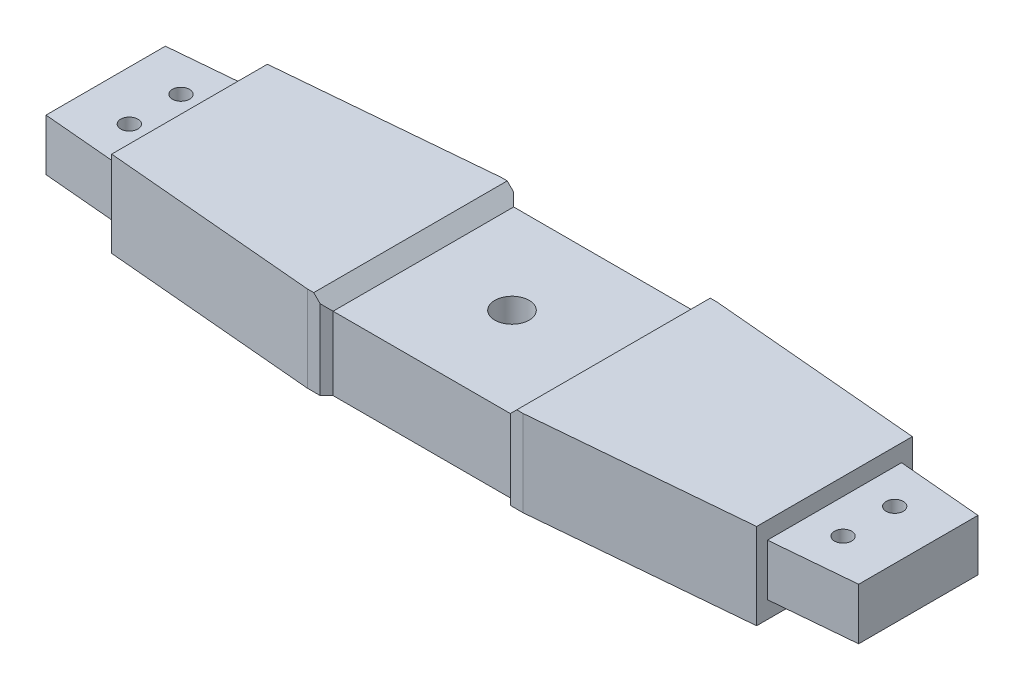
ISO-10303-21;
HEADER;
FILE_DESCRIPTION(('STEP AP214'),'2;1');
FILE_NAME('part.step','',(''),(''),'','','');
FILE_SCHEMA(('AUTOMOTIVE_DESIGN { 1 0 10303 214 1 1 1 1 }'));
ENDSEC;
DATA;
#1=APPLICATION_CONTEXT('core data for automotive mechanical design processes');
#2=APPLICATION_PROTOCOL_DEFINITION('international standard','automotive_design',2000,#1);
#3=PRODUCT_CONTEXT('',#1,'mechanical');
#4=PRODUCT('Part','Part','',(#3));
#5=PRODUCT_RELATED_PRODUCT_CATEGORY('part','',(#4));
#6=PRODUCT_DEFINITION_FORMATION('','',#4);
#7=PRODUCT_DEFINITION_CONTEXT('part definition',#1,'design');
#8=PRODUCT_DEFINITION('design','',#6,#7);
#9=PRODUCT_DEFINITION_SHAPE('','',#8);
#10=(LENGTH_UNIT() NAMED_UNIT(*) SI_UNIT(.MILLI.,.METRE.));
#11=(NAMED_UNIT(*) PLANE_ANGLE_UNIT() SI_UNIT($,.RADIAN.));
#12=(NAMED_UNIT(*) SI_UNIT($,.STERADIAN.) SOLID_ANGLE_UNIT());
#13=UNCERTAINTY_MEASURE_WITH_UNIT(LENGTH_MEASURE(1.E-05),#10,'distance_accuracy_value','');
#14=(GEOMETRIC_REPRESENTATION_CONTEXT(3) GLOBAL_UNCERTAINTY_ASSIGNED_CONTEXT((#13)) GLOBAL_UNIT_ASSIGNED_CONTEXT((#10,
#11,#12)) REPRESENTATION_CONTEXT('',''));
#15=CARTESIAN_POINT('',(0.,0.,0.));
#16=DIRECTION('',(0.,0.,1.));
#17=DIRECTION('',(1.,0.,0.));
#18=AXIS2_PLACEMENT_3D('',#15,#16,#17);
#19=CARTESIAN_POINT('',(0.,-4.,22.5));
#20=DIRECTION('',(0.,0.,1.));
#21=DIRECTION('',(1.,0.,0.));
#22=AXIS2_PLACEMENT_3D('',#19,#20,#21);
#23=PLANE('',#22);
#24=DIRECTION('',(0.,-1.,0.));
#25=VECTOR('',#24,1.);
#26=CARTESIAN_POINT('',(-22.1098777813811,16.,22.5));
#27=LINE('',#26,#25);
#28=CARTESIAN_POINT('',(-22.1098777813811,14.5,22.5));
#29=VERTEX_POINT('',#28);
#30=CARTESIAN_POINT('',(-22.1098777813811,-4.,22.5));
#31=VERTEX_POINT('',#30);
#32=EDGE_CURVE('E330',#29,#31,#27,.T.);
#33=ORIENTED_EDGE('',*,*,#32,.F.);
#34=DIRECTION('',(-0.707106781186552,0.707106781186543,0.));
#35=VECTOR('',#34,1.);
#36=CARTESIAN_POINT('',(-1.8049388906904,-5.80493889069042,22.5));
#37=LINE('',#36,#35);
#38=CARTESIAN_POINT('',(-23.6098777813811,16.,22.5));
#39=VERTEX_POINT('',#38);
#40=EDGE_CURVE('E410',#29,#39,#37,.T.);
#41=ORIENTED_EDGE('',*,*,#40,.T.);
#42=DIRECTION('',(1.,0.,0.));
#43=VECTOR('',#42,1.);
#44=CARTESIAN_POINT('',(0.,16.,22.5));
#45=LINE('',#44,#43);
#46=CARTESIAN_POINT('',(-25.1098777813811,16.,22.5));
#47=VERTEX_POINT('',#46);
#48=EDGE_CURVE('E432',#47,#39,#45,.T.);
#49=ORIENTED_EDGE('',*,*,#48,.F.);
#50=DIRECTION('',(0.,1.,0.));
#51=VECTOR('',#50,1.);
#52=CARTESIAN_POINT('',(-25.1098777813811,-4.,22.5));
#53=LINE('',#52,#51);
#54=CARTESIAN_POINT('',(-25.1098777813811,-4.,22.5));
#55=VERTEX_POINT('',#54);
#56=EDGE_CURVE('E471',#55,#47,#53,.T.);
#57=ORIENTED_EDGE('',*,*,#56,.F.);
#58=DIRECTION('',(1.,0.,0.));
#59=VECTOR('',#58,1.);
#60=CARTESIAN_POINT('',(0.,-4.,22.5));
#61=LINE('',#60,#59);
#62=EDGE_CURVE('E457',#55,#31,#61,.T.);
#63=ORIENTED_EDGE('',*,*,#62,.T.);
#64=EDGE_LOOP('',(#33,#41,#49,#57,#63));
#65=FACE_BOUND('',#64,.T.);
#66=ADVANCED_FACE('F34',(#65),#23,.T.);
#67=CARTESIAN_POINT('',(0.,-4.,-22.5));
#68=DIRECTION('',(0.,0.,-1.));
#69=DIRECTION('',(-1.,0.,0.));
#70=AXIS2_PLACEMENT_3D('',#67,#68,#69);
#71=PLANE('',#70);
#72=DIRECTION('',(0.,-1.,0.));
#73=VECTOR('',#72,1.);
#74=CARTESIAN_POINT('',(-22.1098777813811,16.,-22.5));
#75=LINE('',#74,#73);
#76=CARTESIAN_POINT('',(-22.1098777813811,14.5,-22.5));
#77=VERTEX_POINT('',#76);
#78=CARTESIAN_POINT('',(-22.1098777813811,-4.,-22.5));
#79=VERTEX_POINT('',#78);
#80=EDGE_CURVE('E258',#77,#79,#75,.T.);
#81=ORIENTED_EDGE('',*,*,#80,.T.);
#82=DIRECTION('',(-1.,0.,0.));
#83=VECTOR('',#82,1.);
#84=CARTESIAN_POINT('',(0.,-4.,-22.5));
#85=LINE('',#84,#83);
#86=CARTESIAN_POINT('',(-25.1098777813811,-4.,-22.5));
#87=VERTEX_POINT('',#86);
#88=EDGE_CURVE('E443',#79,#87,#85,.T.);
#89=ORIENTED_EDGE('',*,*,#88,.T.);
#90=DIRECTION('',(0.,1.,0.));
#91=VECTOR('',#90,1.);
#92=CARTESIAN_POINT('',(-25.1098777813811,-4.,-22.5));
#93=LINE('',#92,#91);
#94=CARTESIAN_POINT('',(-25.1098777813811,16.,-22.5));
#95=VERTEX_POINT('',#94);
#96=EDGE_CURVE('E477',#87,#95,#93,.T.);
#97=ORIENTED_EDGE('',*,*,#96,.T.);
#98=DIRECTION('',(-1.,0.,0.));
#99=VECTOR('',#98,1.);
#100=CARTESIAN_POINT('',(0.,16.,-22.5));
#101=LINE('',#100,#99);
#102=CARTESIAN_POINT('',(-23.6098777813811,16.,-22.5));
#103=VERTEX_POINT('',#102);
#104=EDGE_CURVE('E418',#103,#95,#101,.T.);
#105=ORIENTED_EDGE('',*,*,#104,.F.);
#106=DIRECTION('',(-0.707106781186552,0.707106781186543,0.));
#107=VECTOR('',#106,1.);
#108=CARTESIAN_POINT('',(-3.8049388906904,-3.80493889069045,-22.5));
#109=LINE('',#108,#107);
#110=EDGE_CURVE('E390',#77,#103,#109,.T.);
#111=ORIENTED_EDGE('',*,*,#110,.F.);
#112=EDGE_LOOP('',(#81,#89,#97,#105,#111));
#113=FACE_BOUND('',#112,.T.);
#114=ADVANCED_FACE('F554',(#113),#71,.T.);
#115=DIRECTION('',(0.,-1.,0.));
#116=VECTOR('',#115,1.);
#117=CARTESIAN_POINT('',(22.1098777813811,16.,22.5));
#118=LINE('',#117,#116);
#119=CARTESIAN_POINT('',(22.1098777813811,14.5000000000001,22.5));
#120=VERTEX_POINT('',#119);
#121=CARTESIAN_POINT('',(22.1098777813811,-4.,22.5));
#122=VERTEX_POINT('',#121);
#123=EDGE_CURVE('E332',#120,#122,#118,.T.);
#124=ORIENTED_EDGE('',*,*,#123,.T.);
#125=CARTESIAN_POINT('',(25.1098777813811,-4.,22.5));
#126=VERTEX_POINT('',#125);
#127=EDGE_CURVE('E456',#122,#126,#61,.T.);
#128=ORIENTED_EDGE('',*,*,#127,.T.);
#129=DIRECTION('',(0.,1.,0.));
#130=VECTOR('',#129,1.);
#131=CARTESIAN_POINT('',(25.1098777813811,-4.,22.5));
#132=LINE('',#131,#130);
#133=CARTESIAN_POINT('',(25.1098777813811,16.,22.5));
#134=VERTEX_POINT('',#133);
#135=EDGE_CURVE('E468',#126,#134,#132,.T.);
#136=ORIENTED_EDGE('',*,*,#135,.T.);
#137=CARTESIAN_POINT('',(23.6098777813811,16.,22.5));
#138=VERTEX_POINT('',#137);
#139=EDGE_CURVE('E431',#138,#134,#45,.T.);
#140=ORIENTED_EDGE('',*,*,#139,.F.);
#141=DIRECTION('',(-0.707106781186551,-0.707106781186544,0.));
#142=VECTOR('',#141,1.);
#143=CARTESIAN_POINT('',(1.80493889069043,-5.80493889069045,22.5));
#144=LINE('',#143,#142);
#145=EDGE_CURVE('E252',#138,#120,#144,.T.);
#146=ORIENTED_EDGE('',*,*,#145,.T.);
#147=EDGE_LOOP('',(#124,#128,#136,#140,#146));
#148=FACE_BOUND('',#147,.T.);
#149=ADVANCED_FACE('F509',(#148),#23,.T.);
#150=DIRECTION('',(0.,-1.,0.));
#151=VECTOR('',#150,1.);
#152=CARTESIAN_POINT('',(22.1098777813811,16.,-22.5));
#153=LINE('',#152,#151);
#154=CARTESIAN_POINT('',(22.1098777813811,14.5000000000001,-22.5));
#155=VERTEX_POINT('',#154);
#156=CARTESIAN_POINT('',(22.1098777813811,-4.,-22.5));
#157=VERTEX_POINT('',#156);
#158=EDGE_CURVE('E328',#155,#157,#153,.T.);
#159=ORIENTED_EDGE('',*,*,#158,.F.);
#160=DIRECTION('',(-0.707106781186551,-0.707106781186544,0.));
#161=VECTOR('',#160,1.);
#162=CARTESIAN_POINT('',(3.80493889069043,-3.80493889069046,-22.5));
#163=LINE('',#162,#161);
#164=CARTESIAN_POINT('',(23.6098777813811,16.,-22.5));
#165=VERTEX_POINT('',#164);
#166=EDGE_CURVE('E394',#165,#155,#163,.T.);
#167=ORIENTED_EDGE('',*,*,#166,.F.);
#168=CARTESIAN_POINT('',(25.1098777813811,16.,-22.5));
#169=VERTEX_POINT('',#168);
#170=EDGE_CURVE('E419',#169,#165,#101,.T.);
#171=ORIENTED_EDGE('',*,*,#170,.F.);
#172=DIRECTION('',(0.,1.,0.));
#173=VECTOR('',#172,1.);
#174=CARTESIAN_POINT('',(25.1098777813811,-4.,-22.5));
#175=LINE('',#174,#173);
#176=CARTESIAN_POINT('',(25.1098777813811,-4.,-22.5));
#177=VERTEX_POINT('',#176);
#178=EDGE_CURVE('E480',#177,#169,#175,.T.);
#179=ORIENTED_EDGE('',*,*,#178,.F.);
#180=EDGE_CURVE('E444',#177,#157,#85,.T.);
#181=ORIENTED_EDGE('',*,*,#180,.T.);
#182=EDGE_LOOP('',(#159,#167,#171,#179,#181));
#183=FACE_BOUND('',#182,.T.);
#184=ADVANCED_FACE('F505',(#183),#71,.T.);
#185=CARTESIAN_POINT('',(0.,16.,0.));
#186=DIRECTION('',(0.,1.,0.));
#187=DIRECTION('',(0.,0.,1.));
#188=AXIS2_PLACEMENT_3D('',#185,#186,#187);
#189=PLANE('',#188);
#190=ORIENTED_EDGE('',*,*,#48,.T.);
#191=DIRECTION('',(0.,0.,1.));
#192=VECTOR('',#191,1.);
#193=CARTESIAN_POINT('',(-23.6098777813811,16.,-22.5));
#194=LINE('',#193,#192);
#195=EDGE_CURVE('E253',#103,#39,#194,.T.);
#196=ORIENTED_EDGE('',*,*,#195,.F.);
#197=ORIENTED_EDGE('',*,*,#104,.T.);
#198=DIRECTION('',(-0.996144047954509,0.,0.0877327517225179));
#199=VECTOR('',#198,1.);
#200=CARTESIAN_POINT('',(-2.15964694120756,16.,-24.5212808663666));
#201=LINE('',#200,#199);
#202=CARTESIAN_POINT('',(-75.,16.,-18.1060594700135));
#203=VERTEX_POINT('',#202);
#204=EDGE_CURVE('E422',#95,#203,#201,.T.);
#205=ORIENTED_EDGE('',*,*,#204,.T.);
#206=DIRECTION('',(0.,0.,1.));
#207=VECTOR('',#206,1.);
#208=CARTESIAN_POINT('',(-75.,16.,0.));
#209=LINE('',#208,#207);
#210=CARTESIAN_POINT('',(-75.,16.,18.1060594700135));
#211=VERTEX_POINT('',#210);
#212=EDGE_CURVE('E425',#203,#211,#209,.T.);
#213=ORIENTED_EDGE('',*,*,#212,.T.);
#214=DIRECTION('',(0.996144047954509,0.,0.0877327517225178));
#215=VECTOR('',#214,1.);
#216=CARTESIAN_POINT('',(-2.15964694120755,16.,24.5212808663666));
#217=LINE('',#216,#215);
#218=EDGE_CURVE('E428',#211,#47,#217,.T.);
#219=ORIENTED_EDGE('',*,*,#218,.T.);
#220=EDGE_LOOP('',(#190,#196,#197,#205,#213,#219));
#221=FACE_BOUND('',#220,.T.);
#222=ADVANCED_FACE('F546',(#221),#189,.T.);
#223=ORIENTED_EDGE('',*,*,#170,.T.);
#224=DIRECTION('',(0.,0.,1.));
#225=VECTOR('',#224,1.);
#226=CARTESIAN_POINT('',(23.6098777813811,16.,-22.5));
#227=LINE('',#226,#225);
#228=EDGE_CURVE('E400',#165,#138,#227,.T.);
#229=ORIENTED_EDGE('',*,*,#228,.T.);
#230=ORIENTED_EDGE('',*,*,#139,.T.);
#231=DIRECTION('',(0.996144047954509,0.,-0.0877327517225179));
#232=VECTOR('',#231,1.);
#233=CARTESIAN_POINT('',(2.15964694120756,16.,24.5212808663666));
#234=LINE('',#233,#232);
#235=CARTESIAN_POINT('',(75.,16.,18.1060594700135));
#236=VERTEX_POINT('',#235);
#237=EDGE_CURVE('E435',#134,#236,#234,.T.);
#238=ORIENTED_EDGE('',*,*,#237,.T.);
#239=DIRECTION('',(0.,0.,1.));
#240=VECTOR('',#239,1.);
#241=CARTESIAN_POINT('',(75.,16.,0.));
#242=LINE('',#241,#240);
#243=CARTESIAN_POINT('',(75.,16.,-18.1060594700135));
#244=VERTEX_POINT('',#243);
#245=EDGE_CURVE('E412',#244,#236,#242,.T.);
#246=ORIENTED_EDGE('',*,*,#245,.F.);
#247=DIRECTION('',(-0.996144047954509,0.,-0.0877327517225179));
#248=VECTOR('',#247,1.);
#249=CARTESIAN_POINT('',(2.15964694120756,16.,-24.5212808663666));
#250=LINE('',#249,#248);
#251=EDGE_CURVE('E415',#244,#169,#250,.T.);
#252=ORIENTED_EDGE('',*,*,#251,.T.);
#253=EDGE_LOOP('',(#223,#229,#230,#238,#246,#252));
#254=FACE_BOUND('',#253,.T.);
#255=ADVANCED_FACE('F490',(#254),#189,.T.);
#256=CARTESIAN_POINT('',(0.,12.,0.));
#257=DIRECTION('',(0.,-1.,0.));
#258=DIRECTION('',(0.,0.,-1.));
#259=AXIS2_PLACEMENT_3D('',#256,#257,#258);
#260=CYLINDRICAL_SURFACE('',#259,4.);
#261=CARTESIAN_POINT('',(0.,-4.,0.));
#262=DIRECTION('',(0.,1.,0.));
#263=DIRECTION('',(0.,0.,1.));
#264=AXIS2_PLACEMENT_3D('',#261,#262,#263);
#265=CIRCLE('',#264,4.);
#266=CARTESIAN_POINT('',(0.,-4.,4.));
#267=VERTEX_POINT('',#266);
#268=EDGE_CURVE('E463',#267,#267,#265,.F.);
#269=ORIENTED_EDGE('',*,*,#268,.T.);
#270=EDGE_LOOP('',(#269));
#271=FACE_BOUND('',#270,.T.);
#272=CARTESIAN_POINT('',(0.,13.,0.));
#273=DIRECTION('',(0.,1.,0.));
#274=DIRECTION('',(-1.,0.,0.));
#275=AXIS2_PLACEMENT_3D('',#272,#273,#274);
#276=CIRCLE('',#275,4.);
#277=CARTESIAN_POINT('',(-4.,13.,0.));
#278=VERTEX_POINT('',#277);
#279=EDGE_CURVE('E249',#278,#278,#276,.T.);
#280=ORIENTED_EDGE('',*,*,#279,.T.);
#281=EDGE_LOOP('',(#280));
#282=FACE_BOUND('',#281,.T.);
#283=ADVANCED_FACE('F36',(#271,#282),#260,.F.);
#284=CARTESIAN_POINT('',(1.94031506190126,12.,22.0309207464803));
#285=DIRECTION('',(-0.0877327517225179,0.,-0.996144047954509));
#286=DIRECTION('',(-0.996144047954509,0.,0.0877327517225179));
#287=AXIS2_PLACEMENT_3D('',#284,#285,#286);
#288=PLANE('',#287);
#289=DIRECTION('',(0.996144047954509,0.,-0.0877327517225179));
#290=VECTOR('',#289,1.);
#291=CARTESIAN_POINT('',(1.94031506190126,0.,22.0309207464803));
#292=LINE('',#291,#290);
#293=CARTESIAN_POINT('',(75.,0.,15.5963822751002));
#294=VERTEX_POINT('',#293);
#295=CARTESIAN_POINT('',(94.5,0.,13.8789713623893));
#296=VERTEX_POINT('',#295);
#297=EDGE_CURVE('E234',#294,#296,#292,.T.);
#298=ORIENTED_EDGE('',*,*,#297,.T.);
#299=DIRECTION('',(0.,1.,0.));
#300=VECTOR('',#299,1.);
#301=CARTESIAN_POINT('',(94.5,-4.,13.8789713623893));
#302=LINE('',#301,#300);
#303=CARTESIAN_POINT('',(94.5,12.,13.8789713623893));
#304=VERTEX_POINT('',#303);
#305=EDGE_CURVE('E49',#296,#304,#302,.T.);
#306=ORIENTED_EDGE('',*,*,#305,.T.);
#307=DIRECTION('',(0.996144047954509,0.,-0.0877327517225179));
#308=VECTOR('',#307,1.);
#309=CARTESIAN_POINT('',(1.94031506190126,12.,22.0309207464803));
#310=LINE('',#309,#308);
#311=CARTESIAN_POINT('',(75.,12.,15.5963822751002));
#312=VERTEX_POINT('',#311);
#313=EDGE_CURVE('E244',#312,#304,#310,.T.);
#314=ORIENTED_EDGE('',*,*,#313,.F.);
#315=DIRECTION('',(0.,1.,0.));
#316=VECTOR('',#315,1.);
#317=CARTESIAN_POINT('',(75.,12.,15.5963822751002));
#318=LINE('',#317,#316);
#319=EDGE_CURVE('E290',#294,#312,#318,.T.);
#320=ORIENTED_EDGE('',*,*,#319,.F.);
#321=EDGE_LOOP('',(#298,#306,#314,#320));
#322=FACE_BOUND('',#321,.T.);
#323=ADVANCED_FACE('F315',(#322),#288,.F.);
#324=CARTESIAN_POINT('',(1.94031506190126,12.,-22.0309207464803));
#325=DIRECTION('',(0.0877327517225179,0.,-0.996144047954509));
#326=DIRECTION('',(-0.996144047954509,0.,-0.0877327517225179));
#327=AXIS2_PLACEMENT_3D('',#324,#325,#326);
#328=PLANE('',#327);
#329=DIRECTION('',(0.,1.,0.));
#330=VECTOR('',#329,1.);
#331=CARTESIAN_POINT('',(94.5,-4.,-13.8789713623893));
#332=LINE('',#331,#330);
#333=CARTESIAN_POINT('',(94.5,0.,-13.8789713623893));
#334=VERTEX_POINT('',#333);
#335=CARTESIAN_POINT('',(94.5,12.,-13.8789713623893));
#336=VERTEX_POINT('',#335);
#337=EDGE_CURVE('E301',#334,#336,#332,.T.);
#338=ORIENTED_EDGE('',*,*,#337,.F.);
#339=DIRECTION('',(0.996144047954509,0.,0.0877327517225179));
#340=VECTOR('',#339,1.);
#341=CARTESIAN_POINT('',(1.94031506190126,0.,-22.0309207464803));
#342=LINE('',#341,#340);
#343=CARTESIAN_POINT('',(75.,0.,-15.5963822751002));
#344=VERTEX_POINT('',#343);
#345=EDGE_CURVE('E237',#344,#334,#342,.T.);
#346=ORIENTED_EDGE('',*,*,#345,.F.);
#347=DIRECTION('',(0.,1.,0.));
#348=VECTOR('',#347,1.);
#349=CARTESIAN_POINT('',(75.,12.,-15.5963822751002));
#350=LINE('',#349,#348);
#351=CARTESIAN_POINT('',(75.,12.,-15.5963822751002));
#352=VERTEX_POINT('',#351);
#353=EDGE_CURVE('E283',#344,#352,#350,.T.);
#354=ORIENTED_EDGE('',*,*,#353,.T.);
#355=DIRECTION('',(0.996144047954509,0.,0.0877327517225179));
#356=VECTOR('',#355,1.);
#357=CARTESIAN_POINT('',(1.94031506190126,12.,-22.0309207464803));
#358=LINE('',#357,#356);
#359=EDGE_CURVE('E230',#352,#336,#358,.T.);
#360=ORIENTED_EDGE('',*,*,#359,.T.);
#361=EDGE_LOOP('',(#338,#346,#354,#360));
#362=FACE_BOUND('',#361,.T.);
#363=ADVANCED_FACE('F299',(#362),#328,.T.);
#364=CARTESIAN_POINT('',(0.,12.,0.));
#365=DIRECTION('',(0.,1.,0.));
#366=DIRECTION('',(0.,0.,1.));
#367=AXIS2_PLACEMENT_3D('',#364,#365,#366);
#368=PLANE('',#367);
#369=DIRECTION('',(0.,0.,1.));
#370=VECTOR('',#369,1.);
#371=CARTESIAN_POINT('',(94.5,12.,-13.8789713623893));
#372=LINE('',#371,#370);
#373=EDGE_CURVE('E309',#336,#304,#372,.T.);
#374=ORIENTED_EDGE('',*,*,#373,.F.);
#375=ORIENTED_EDGE('',*,*,#359,.F.);
#376=DIRECTION('',(0.,0.,1.));
#377=VECTOR('',#376,1.);
#378=CARTESIAN_POINT('',(75.,12.,0.));
#379=LINE('',#378,#377);
#380=EDGE_CURVE('E238',#352,#312,#379,.T.);
#381=ORIENTED_EDGE('',*,*,#380,.T.);
#382=ORIENTED_EDGE('',*,*,#313,.T.);
#383=EDGE_LOOP('',(#374,#375,#381,#382));
#384=FACE_BOUND('',#383,.T.);
#385=CARTESIAN_POINT('',(83.,12.,-5.99999999999997));
#386=DIRECTION('',(0.,1.,0.));
#387=DIRECTION('',(0.,0.,1.));
#388=AXIS2_PLACEMENT_3D('',#385,#386,#387);
#389=CIRCLE('',#388,2.);
#390=CARTESIAN_POINT('',(83.,12.,-3.99999999999997));
#391=VERTEX_POINT('',#390);
#392=EDGE_CURVE('E383',#391,#391,#389,.T.);
#393=ORIENTED_EDGE('',*,*,#392,.F.);
#394=EDGE_LOOP('',(#393));
#395=FACE_BOUND('',#394,.T.);
#396=CARTESIAN_POINT('',(83.,12.,6.00000000000002));
#397=DIRECTION('',(0.,1.,0.));
#398=DIRECTION('',(0.,0.,1.));
#399=AXIS2_PLACEMENT_3D('',#396,#397,#398);
#400=CIRCLE('',#399,2.);
#401=CARTESIAN_POINT('',(83.,12.,8.00000000000002));
#402=VERTEX_POINT('',#401);
#403=EDGE_CURVE('E380',#402,#402,#400,.T.);
#404=ORIENTED_EDGE('',*,*,#403,.F.);
#405=EDGE_LOOP('',(#404));
#406=FACE_BOUND('',#405,.T.);
#407=ADVANCED_FACE('F306',(#384,#395,#406),#368,.T.);
#408=CARTESIAN_POINT('',(0.,0.,0.));
#409=DIRECTION('',(0.,1.,0.));
#410=DIRECTION('',(0.,0.,1.));
#411=AXIS2_PLACEMENT_3D('',#408,#409,#410);
#412=PLANE('',#411);
#413=CARTESIAN_POINT('',(83.,0.,-5.99999999999997));
#414=DIRECTION('',(0.,-1.,0.));
#415=DIRECTION('',(0.,0.,1.));
#416=AXIS2_PLACEMENT_3D('',#413,#414,#415);
#417=CIRCLE('',#416,2.);
#418=CARTESIAN_POINT('',(83.,0.,-3.99999999999997));
#419=VERTEX_POINT('',#418);
#420=EDGE_CURVE('E362',#419,#419,#417,.T.);
#421=ORIENTED_EDGE('',*,*,#420,.F.);
#422=EDGE_LOOP('',(#421));
#423=FACE_BOUND('',#422,.T.);
#424=CARTESIAN_POINT('',(83.,0.,6.00000000000002));
#425=DIRECTION('',(0.,-1.,0.));
#426=DIRECTION('',(0.,0.,1.));
#427=AXIS2_PLACEMENT_3D('',#424,#425,#426);
#428=CIRCLE('',#427,2.);
#429=CARTESIAN_POINT('',(83.,0.,8.00000000000002));
#430=VERTEX_POINT('',#429);
#431=EDGE_CURVE('E367',#430,#430,#428,.T.);
#432=ORIENTED_EDGE('',*,*,#431,.F.);
#433=EDGE_LOOP('',(#432));
#434=FACE_BOUND('',#433,.T.);
#435=ORIENTED_EDGE('',*,*,#345,.T.);
#436=DIRECTION('',(0.,0.,1.));
#437=VECTOR('',#436,1.);
#438=CARTESIAN_POINT('',(94.5,0.,0.));
#439=LINE('',#438,#437);
#440=EDGE_CURVE('E11',#334,#296,#439,.T.);
#441=ORIENTED_EDGE('',*,*,#440,.T.);
#442=ORIENTED_EDGE('',*,*,#297,.F.);
#443=DIRECTION('',(0.,0.,1.));
#444=VECTOR('',#443,1.);
#445=CARTESIAN_POINT('',(75.,0.,0.));
#446=LINE('',#445,#444);
#447=EDGE_CURVE('E228',#344,#294,#446,.T.);
#448=ORIENTED_EDGE('',*,*,#447,.F.);
#449=EDGE_LOOP('',(#435,#441,#442,#448));
#450=FACE_BOUND('',#449,.T.);
#451=ADVANCED_FACE('F598',(#423,#434,#450),#412,.F.);
#452=CARTESIAN_POINT('',(75.,-4.,0.));
#453=DIRECTION('',(-1.,0.,0.));
#454=DIRECTION('',(0.,0.,1.));
#455=AXIS2_PLACEMENT_3D('',#452,#453,#454);
#456=PLANE('',#455);
#457=ORIENTED_EDGE('',*,*,#380,.F.);
#458=ORIENTED_EDGE('',*,*,#353,.F.);
#459=ORIENTED_EDGE('',*,*,#447,.T.);
#460=ORIENTED_EDGE('',*,*,#319,.T.);
#461=EDGE_LOOP('',(#457,#458,#459,#460));
#462=FACE_BOUND('',#461,.T.);
#463=DIRECTION('',(0.,1.,0.));
#464=VECTOR('',#463,1.);
#465=CARTESIAN_POINT('',(75.,-4.,-18.1060594700135));
#466=LINE('',#465,#464);
#467=CARTESIAN_POINT('',(75.,-4.,-18.1060594700135));
#468=VERTEX_POINT('',#467);
#469=EDGE_CURVE('E466',#468,#244,#466,.T.);
#470=ORIENTED_EDGE('',*,*,#469,.T.);
#471=ORIENTED_EDGE('',*,*,#245,.T.);
#472=DIRECTION('',(0.,1.,0.));
#473=VECTOR('',#472,1.);
#474=CARTESIAN_POINT('',(75.,-4.,18.1060594700135));
#475=LINE('',#474,#473);
#476=CARTESIAN_POINT('',(75.,-4.,18.1060594700135));
#477=VERTEX_POINT('',#476);
#478=EDGE_CURVE('E285',#477,#236,#475,.T.);
#479=ORIENTED_EDGE('',*,*,#478,.F.);
#480=DIRECTION('',(0.,0.,1.));
#481=VECTOR('',#480,1.);
#482=CARTESIAN_POINT('',(75.,-4.,0.));
#483=LINE('',#482,#481);
#484=EDGE_CURVE('E438',#468,#477,#483,.T.);
#485=ORIENTED_EDGE('',*,*,#484,.F.);
#486=EDGE_LOOP('',(#470,#471,#479,#485));
#487=FACE_BOUND('',#486,.T.);
#488=ADVANCED_FACE('F311',(#462,#487),#456,.F.);
#489=CARTESIAN_POINT('',(2.15964694120756,-4.,24.5212808663666));
#490=DIRECTION('',(0.0877327517225179,0.,0.996144047954509));
#491=DIRECTION('',(0.996144047954509,0.,-0.0877327517225179));
#492=AXIS2_PLACEMENT_3D('',#489,#490,#491);
#493=PLANE('',#492);
#494=ORIENTED_EDGE('',*,*,#478,.T.);
#495=ORIENTED_EDGE('',*,*,#237,.F.);
#496=ORIENTED_EDGE('',*,*,#135,.F.);
#497=DIRECTION('',(0.996144047954509,0.,-0.0877327517225179));
#498=VECTOR('',#497,1.);
#499=CARTESIAN_POINT('',(2.15964694120756,-4.,24.5212808663666));
#500=LINE('',#499,#498);
#501=EDGE_CURVE('E460',#126,#477,#500,.T.);
#502=ORIENTED_EDGE('',*,*,#501,.T.);
#503=EDGE_LOOP('',(#494,#495,#496,#502));
#504=FACE_BOUND('',#503,.T.);
#505=ADVANCED_FACE('F495',(#504),#493,.T.);
#506=CARTESIAN_POINT('',(-2.15964694120755,-4.,24.5212808663666));
#507=DIRECTION('',(-0.0877327517225178,0.,0.996144047954509));
#508=DIRECTION('',(0.996144047954509,0.,0.0877327517225178));
#509=AXIS2_PLACEMENT_3D('',#506,#507,#508);
#510=PLANE('',#509);
#511=ORIENTED_EDGE('',*,*,#56,.T.);
#512=ORIENTED_EDGE('',*,*,#218,.F.);
#513=DIRECTION('',(0.,1.,0.));
#514=VECTOR('',#513,1.);
#515=CARTESIAN_POINT('',(-75.,-4.,18.1060594700135));
#516=LINE('',#515,#514);
#517=CARTESIAN_POINT('',(-75.,-4.,18.1060594700135));
#518=VERTEX_POINT('',#517);
#519=EDGE_CURVE('E473',#518,#211,#516,.T.);
#520=ORIENTED_EDGE('',*,*,#519,.F.);
#521=DIRECTION('',(0.996144047954509,0.,0.0877327517225178));
#522=VECTOR('',#521,1.);
#523=CARTESIAN_POINT('',(-2.15964694120755,-4.,24.5212808663666));
#524=LINE('',#523,#522);
#525=EDGE_CURVE('E453',#518,#55,#524,.T.);
#526=ORIENTED_EDGE('',*,*,#525,.T.);
#527=EDGE_LOOP('',(#511,#512,#520,#526));
#528=FACE_BOUND('',#527,.T.);
#529=ADVANCED_FACE('F540',(#528),#510,.T.);
#530=CARTESIAN_POINT('',(-75.,-4.,0.));
#531=DIRECTION('',(-1.,0.,0.));
#532=DIRECTION('',(0.,0.,1.));
#533=AXIS2_PLACEMENT_3D('',#530,#531,#532);
#534=PLANE('',#533);
#535=DIRECTION('',(0.,1.,0.));
#536=VECTOR('',#535,1.);
#537=CARTESIAN_POINT('',(-75.,12.,-15.5963822751002));
#538=LINE('',#537,#536);
#539=CARTESIAN_POINT('',(-75.,0.,-15.5963822751002));
#540=VERTEX_POINT('',#539);
#541=CARTESIAN_POINT('',(-75.,12.,-15.5963822751002));
#542=VERTEX_POINT('',#541);
#543=EDGE_CURVE('E279',#540,#542,#538,.T.);
#544=ORIENTED_EDGE('',*,*,#543,.T.);
#545=DIRECTION('',(0.,0.,1.));
#546=VECTOR('',#545,1.);
#547=CARTESIAN_POINT('',(-75.,12.,0.));
#548=LINE('',#547,#546);
#549=CARTESIAN_POINT('',(-75.,12.,15.5963822751002));
#550=VERTEX_POINT('',#549);
#551=EDGE_CURVE('E281',#542,#550,#548,.T.);
#552=ORIENTED_EDGE('',*,*,#551,.T.);
#553=DIRECTION('',(0.,1.,0.));
#554=VECTOR('',#553,1.);
#555=CARTESIAN_POINT('',(-75.,12.,15.5963822751002));
#556=LINE('',#555,#554);
#557=CARTESIAN_POINT('',(-75.,0.,15.5963822751002));
#558=VERTEX_POINT('',#557);
#559=EDGE_CURVE('E224',#558,#550,#556,.T.);
#560=ORIENTED_EDGE('',*,*,#559,.F.);
#561=DIRECTION('',(0.,0.,1.));
#562=VECTOR('',#561,1.);
#563=CARTESIAN_POINT('',(-75.,0.,0.));
#564=LINE('',#563,#562);
#565=EDGE_CURVE('E225',#540,#558,#564,.T.);
#566=ORIENTED_EDGE('',*,*,#565,.F.);
#567=EDGE_LOOP('',(#544,#552,#560,#566));
#568=FACE_BOUND('',#567,.T.);
#569=ORIENTED_EDGE('',*,*,#519,.T.);
#570=ORIENTED_EDGE('',*,*,#212,.F.);
#571=DIRECTION('',(0.,1.,0.));
#572=VECTOR('',#571,1.);
#573=CARTESIAN_POINT('',(-75.,-4.,-18.1060594700135));
#574=LINE('',#573,#572);
#575=CARTESIAN_POINT('',(-75.,-4.,-18.1060594700135));
#576=VERTEX_POINT('',#575);
#577=EDGE_CURVE('E475',#576,#203,#574,.T.);
#578=ORIENTED_EDGE('',*,*,#577,.F.);
#579=DIRECTION('',(0.,0.,1.));
#580=VECTOR('',#579,1.);
#581=CARTESIAN_POINT('',(-75.,-4.,0.));
#582=LINE('',#581,#580);
#583=EDGE_CURVE('E450',#576,#518,#582,.T.);
#584=ORIENTED_EDGE('',*,*,#583,.T.);
#585=EDGE_LOOP('',(#569,#570,#578,#584));
#586=FACE_BOUND('',#585,.T.);
#587=ADVANCED_FACE('F544',(#568,#586),#534,.T.);
#588=CARTESIAN_POINT('',(-2.15964694120756,-4.,-24.5212808663666));
#589=DIRECTION('',(-0.087732751722518,0.,-0.996144047954509));
#590=DIRECTION('',(-0.996144047954509,0.,0.087732751722518));
#591=AXIS2_PLACEMENT_3D('',#588,#589,#590);
#592=PLANE('',#591);
#593=ORIENTED_EDGE('',*,*,#577,.T.);
#594=ORIENTED_EDGE('',*,*,#204,.F.);
#595=ORIENTED_EDGE('',*,*,#96,.F.);
#596=DIRECTION('',(-0.996144047954509,0.,0.0877327517225179));
#597=VECTOR('',#596,1.);
#598=CARTESIAN_POINT('',(-2.15964694120756,-4.,-24.5212808663666));
#599=LINE('',#598,#597);
#600=EDGE_CURVE('E447',#87,#576,#599,.T.);
#601=ORIENTED_EDGE('',*,*,#600,.T.);
#602=EDGE_LOOP('',(#593,#594,#595,#601));
#603=FACE_BOUND('',#602,.T.);
#604=ADVANCED_FACE('F551',(#603),#592,.T.);
#605=CARTESIAN_POINT('',(2.15964694120756,-4.,-24.5212808663666));
#606=DIRECTION('',(0.0877327517225179,0.,-0.996144047954509));
#607=DIRECTION('',(-0.996144047954509,0.,-0.0877327517225179));
#608=AXIS2_PLACEMENT_3D('',#605,#606,#607);
#609=PLANE('',#608);
#610=ORIENTED_EDGE('',*,*,#178,.T.);
#611=ORIENTED_EDGE('',*,*,#251,.F.);
#612=ORIENTED_EDGE('',*,*,#469,.F.);
#613=DIRECTION('',(-0.996144047954509,0.,-0.0877327517225179));
#614=VECTOR('',#613,1.);
#615=CARTESIAN_POINT('',(2.15964694120756,-4.,-24.5212808663666));
#616=LINE('',#615,#614);
#617=EDGE_CURVE('E440',#468,#177,#616,.T.);
#618=ORIENTED_EDGE('',*,*,#617,.T.);
#619=EDGE_LOOP('',(#610,#611,#612,#618));
#620=FACE_BOUND('',#619,.T.);
#621=ADVANCED_FACE('F487',(#620),#609,.T.);
#622=CARTESIAN_POINT('',(0.,-4.,0.));
#623=DIRECTION('',(0.,1.,0.));
#624=DIRECTION('',(0.,0.,1.));
#625=AXIS2_PLACEMENT_3D('',#622,#623,#624);
#626=PLANE('',#625);
#627=ORIENTED_EDGE('',*,*,#88,.F.);
#628=DIRECTION('',(0.707106781186552,0.,0.707106781186543));
#629=VECTOR('',#628,1.);
#630=CARTESIAN_POINT('',(0.195061109309583,-4.,-0.195061109309585));
#631=LINE('',#630,#629);
#632=CARTESIAN_POINT('',(-20.6098777813811,-4.,-21.));
#633=VERTEX_POINT('',#632);
#634=EDGE_CURVE('E359',#79,#633,#631,.T.);
#635=ORIENTED_EDGE('',*,*,#634,.T.);
#636=DIRECTION('',(1.,0.,0.));
#637=VECTOR('',#636,1.);
#638=CARTESIAN_POINT('',(0.,-4.,-21.));
#639=LINE('',#638,#637);
#640=CARTESIAN_POINT('',(20.6098777813811,-4.,-21.));
#641=VERTEX_POINT('',#640);
#642=EDGE_CURVE('E344',#633,#641,#639,.T.);
#643=ORIENTED_EDGE('',*,*,#642,.T.);
#644=DIRECTION('',(0.707106781186544,0.,-0.707106781186551));
#645=VECTOR('',#644,1.);
#646=CARTESIAN_POINT('',(-0.195061109309344,-4.,-0.195061109309343));
#647=LINE('',#646,#645);
#648=EDGE_CURVE('E353',#641,#157,#647,.T.);
#649=ORIENTED_EDGE('',*,*,#648,.T.);
#650=ORIENTED_EDGE('',*,*,#180,.F.);
#651=ORIENTED_EDGE('',*,*,#617,.F.);
#652=ORIENTED_EDGE('',*,*,#484,.T.);
#653=ORIENTED_EDGE('',*,*,#501,.F.);
#654=ORIENTED_EDGE('',*,*,#127,.F.);
#655=DIRECTION('',(-0.707106781186544,0.,-0.707106781186551));
#656=VECTOR('',#655,1.);
#657=CARTESIAN_POINT('',(-0.195061109309344,-4.,0.195061109309343));
#658=LINE('',#657,#656);
#659=CARTESIAN_POINT('',(20.6098777813811,-4.,21.));
#660=VERTEX_POINT('',#659);
#661=EDGE_CURVE('E350',#122,#660,#658,.T.);
#662=ORIENTED_EDGE('',*,*,#661,.T.);
#663=DIRECTION('',(-1.,0.,0.));
#664=VECTOR('',#663,1.);
#665=CARTESIAN_POINT('',(0.,-4.,21.));
#666=LINE('',#665,#664);
#667=CARTESIAN_POINT('',(-20.6098777813811,-4.,21.));
#668=VERTEX_POINT('',#667);
#669=EDGE_CURVE('E347',#660,#668,#666,.T.);
#670=ORIENTED_EDGE('',*,*,#669,.T.);
#671=DIRECTION('',(-0.707106781186552,0.,0.707106781186543));
#672=VECTOR('',#671,1.);
#673=CARTESIAN_POINT('',(0.195061109309583,-4.,0.195061109309585));
#674=LINE('',#673,#672);
#675=EDGE_CURVE('E356',#668,#31,#674,.T.);
#676=ORIENTED_EDGE('',*,*,#675,.T.);
#677=ORIENTED_EDGE('',*,*,#62,.F.);
#678=ORIENTED_EDGE('',*,*,#525,.F.);
#679=ORIENTED_EDGE('',*,*,#583,.F.);
#680=ORIENTED_EDGE('',*,*,#600,.F.);
#681=EDGE_LOOP('',(#627,#635,#643,#649,#650,#651,#652,#653,#654,#662,#670,#676,#677,#678,#679,#680));
#682=FACE_BOUND('',#681,.T.);
#683=ORIENTED_EDGE('',*,*,#268,.F.);
#684=EDGE_LOOP('',(#683));
#685=FACE_BOUND('',#684,.T.);
#686=ADVANCED_FACE('F500',(#682,#685),#626,.F.);
#687=DIRECTION('',(0.,0.,-1.));
#688=VECTOR('',#687,1.);
#689=CARTESIAN_POINT('',(-94.5,12.,-13.8789713623893));
#690=LINE('',#689,#688);
#691=CARTESIAN_POINT('',(-94.5,12.,13.8789713623893));
#692=VERTEX_POINT('',#691);
#693=CARTESIAN_POINT('',(-94.5,12.,-13.8789713623893));
#694=VERTEX_POINT('',#693);
#695=EDGE_CURVE('E56',#692,#694,#690,.T.);
#696=ORIENTED_EDGE('',*,*,#695,.F.);
#697=DIRECTION('',(0.996144047954509,0.,0.0877327517225179));
#698=VECTOR('',#697,1.);
#699=CARTESIAN_POINT('',(-1.94031506190126,12.,22.0309207464803));
#700=LINE('',#699,#698);
#701=EDGE_CURVE('E217',#692,#550,#700,.T.);
#702=ORIENTED_EDGE('',*,*,#701,.T.);
#703=ORIENTED_EDGE('',*,*,#551,.F.);
#704=DIRECTION('',(0.996144047954509,0.,-0.0877327517225179));
#705=VECTOR('',#704,1.);
#706=CARTESIAN_POINT('',(-1.94031506190126,12.,-22.0309207464803));
#707=LINE('',#706,#705);
#708=EDGE_CURVE('E219',#694,#542,#707,.T.);
#709=ORIENTED_EDGE('',*,*,#708,.F.);
#710=EDGE_LOOP('',(#696,#702,#703,#709));
#711=FACE_BOUND('',#710,.T.);
#712=CARTESIAN_POINT('',(-83.,12.,6.));
#713=DIRECTION('',(0.,1.,0.));
#714=DIRECTION('',(0.,0.,1.));
#715=AXIS2_PLACEMENT_3D('',#712,#713,#714);
#716=CIRCLE('',#715,2.);
#717=CARTESIAN_POINT('',(-83.,12.,8.));
#718=VERTEX_POINT('',#717);
#719=EDGE_CURVE('E377',#718,#718,#716,.T.);
#720=ORIENTED_EDGE('',*,*,#719,.F.);
#721=EDGE_LOOP('',(#720));
#722=FACE_BOUND('',#721,.T.);
#723=CARTESIAN_POINT('',(-83.,12.,-6.));
#724=DIRECTION('',(0.,1.,0.));
#725=DIRECTION('',(0.,0.,1.));
#726=AXIS2_PLACEMENT_3D('',#723,#724,#725);
#727=CIRCLE('',#726,2.);
#728=CARTESIAN_POINT('',(-83.,12.,-4.));
#729=VERTEX_POINT('',#728);
#730=EDGE_CURVE('E374',#729,#729,#727,.T.);
#731=ORIENTED_EDGE('',*,*,#730,.F.);
#732=EDGE_LOOP('',(#731));
#733=FACE_BOUND('',#732,.T.);
#734=ADVANCED_FACE('F214',(#711,#722,#733),#368,.T.);
#735=CARTESIAN_POINT('',(-83.,0.,6.));
#736=DIRECTION('',(0.,-1.,0.));
#737=DIRECTION('',(0.,0.,-1.));
#738=AXIS2_PLACEMENT_3D('',#735,#736,#737);
#739=CIRCLE('',#738,2.);
#740=CARTESIAN_POINT('',(-83.,0.,4.));
#741=VERTEX_POINT('',#740);
#742=EDGE_CURVE('E363',#741,#741,#739,.T.);
#743=ORIENTED_EDGE('',*,*,#742,.F.);
#744=EDGE_LOOP('',(#743));
#745=FACE_BOUND('',#744,.T.);
#746=CARTESIAN_POINT('',(-83.,0.,-6.));
#747=DIRECTION('',(0.,-1.,0.));
#748=DIRECTION('',(0.,0.,-1.));
#749=AXIS2_PLACEMENT_3D('',#746,#747,#748);
#750=CIRCLE('',#749,2.);
#751=CARTESIAN_POINT('',(-83.,0.,-8.));
#752=VERTEX_POINT('',#751);
#753=EDGE_CURVE('E366',#752,#752,#750,.T.);
#754=ORIENTED_EDGE('',*,*,#753,.F.);
#755=EDGE_LOOP('',(#754));
#756=FACE_BOUND('',#755,.T.);
#757=DIRECTION('',(0.996144047954509,0.,0.0877327517225179));
#758=VECTOR('',#757,1.);
#759=CARTESIAN_POINT('',(-1.94031506190126,0.,22.0309207464803));
#760=LINE('',#759,#758);
#761=CARTESIAN_POINT('',(-94.5,0.,13.8789713623893));
#762=VERTEX_POINT('',#761);
#763=EDGE_CURVE('E243',#762,#558,#760,.T.);
#764=ORIENTED_EDGE('',*,*,#763,.F.);
#765=DIRECTION('',(0.,0.,-1.));
#766=VECTOR('',#765,1.);
#767=CARTESIAN_POINT('',(-94.5,0.,0.));
#768=LINE('',#767,#766);
#769=CARTESIAN_POINT('',(-94.5,0.,-13.8789713623893));
#770=VERTEX_POINT('',#769);
#771=EDGE_CURVE('E207',#762,#770,#768,.T.);
#772=ORIENTED_EDGE('',*,*,#771,.T.);
#773=DIRECTION('',(0.996144047954509,0.,-0.0877327517225179));
#774=VECTOR('',#773,1.);
#775=CARTESIAN_POINT('',(-1.94031506190126,0.,-22.0309207464803));
#776=LINE('',#775,#774);
#777=EDGE_CURVE('E241',#770,#540,#776,.T.);
#778=ORIENTED_EDGE('',*,*,#777,.T.);
#779=ORIENTED_EDGE('',*,*,#565,.T.);
#780=EDGE_LOOP('',(#764,#772,#778,#779));
#781=FACE_BOUND('',#780,.T.);
#782=ADVANCED_FACE('F272',(#745,#756,#781),#412,.F.);
#783=CARTESIAN_POINT('',(-1.94031506190126,12.,22.0309207464803));
#784=DIRECTION('',(0.0877327517225178,0.,-0.996144047954509));
#785=DIRECTION('',(-0.996144047954509,0.,-0.0877327517225179));
#786=AXIS2_PLACEMENT_3D('',#783,#784,#785);
#787=PLANE('',#786);
#788=ORIENTED_EDGE('',*,*,#701,.F.);
#789=DIRECTION('',(0.,1.,0.));
#790=VECTOR('',#789,1.);
#791=CARTESIAN_POINT('',(-94.5,-4.,13.8789713623893));
#792=LINE('',#791,#790);
#793=EDGE_CURVE('E204',#762,#692,#792,.T.);
#794=ORIENTED_EDGE('',*,*,#793,.F.);
#795=ORIENTED_EDGE('',*,*,#763,.T.);
#796=ORIENTED_EDGE('',*,*,#559,.T.);
#797=EDGE_LOOP('',(#788,#794,#795,#796));
#798=FACE_BOUND('',#797,.T.);
#799=ADVANCED_FACE('F222',(#798),#787,.F.);
#800=CARTESIAN_POINT('',(-1.94031506190126,12.,-22.0309207464803));
#801=DIRECTION('',(-0.0877327517225178,0.,-0.996144047954509));
#802=DIRECTION('',(-0.996144047954509,0.,0.0877327517225179));
#803=AXIS2_PLACEMENT_3D('',#800,#801,#802);
#804=PLANE('',#803);
#805=DIRECTION('',(0.,-1.,0.));
#806=VECTOR('',#805,1.);
#807=CARTESIAN_POINT('',(-94.5,12.,-13.8789713623893));
#808=LINE('',#807,#806);
#809=EDGE_CURVE('E42',#694,#770,#808,.T.);
#810=ORIENTED_EDGE('',*,*,#809,.F.);
#811=ORIENTED_EDGE('',*,*,#708,.T.);
#812=ORIENTED_EDGE('',*,*,#543,.F.);
#813=ORIENTED_EDGE('',*,*,#777,.F.);
#814=EDGE_LOOP('',(#810,#811,#812,#813));
#815=FACE_BOUND('',#814,.T.);
#816=ADVANCED_FACE('F277',(#815),#804,.T.);
#817=CARTESIAN_POINT('',(-3.8049388906904,-3.80493889069045,-22.5));
#818=DIRECTION('',(0.707106781186543,0.707106781186552,0.));
#819=DIRECTION('',(-0.707106781186552,0.707106781186543,0.));
#820=AXIS2_PLACEMENT_3D('',#817,#818,#819);
#821=PLANE('',#820);
#822=DIRECTION('',(0.57735026918963,-0.577350269189623,0.577350269189624));
#823=VECTOR('',#822,1.);
#824=CARTESIAN_POINT('',(-9.90658518758725,2.29670740620633,-10.2967074062063));
#825=LINE('',#824,#823);
#826=CARTESIAN_POINT('',(-20.6098777813811,13.,-21.));
#827=VERTEX_POINT('',#826);
#828=EDGE_CURVE('E267',#77,#827,#825,.T.);
#829=ORIENTED_EDGE('',*,*,#828,.F.);
#830=ORIENTED_EDGE('',*,*,#110,.T.);
#831=ORIENTED_EDGE('',*,*,#195,.T.);
#832=ORIENTED_EDGE('',*,*,#40,.F.);
#833=DIRECTION('',(-0.57735026918963,0.577350269189623,0.577350269189624));
#834=VECTOR('',#833,1.);
#835=CARTESIAN_POINT('',(5.09341481241281,-12.7032925937936,-4.70329259379359));
#836=LINE('',#835,#834);
#837=CARTESIAN_POINT('',(-20.6098777813811,13.,21.));
#838=VERTEX_POINT('',#837);
#839=EDGE_CURVE('E265',#838,#29,#836,.T.);
#840=ORIENTED_EDGE('',*,*,#839,.F.);
#841=DIRECTION('',(0.,0.,1.));
#842=VECTOR('',#841,1.);
#843=CARTESIAN_POINT('',(-20.6098777813811,13.,-22.5));
#844=LINE('',#843,#842);
#845=EDGE_CURVE('E397',#827,#838,#844,.T.);
#846=ORIENTED_EDGE('',*,*,#845,.F.);
#847=EDGE_LOOP('',(#829,#830,#831,#832,#840,#846));
#848=FACE_BOUND('',#847,.T.);
#849=ADVANCED_FACE('F532',(#848),#821,.T.);
#850=CARTESIAN_POINT('',(3.80493889069043,-3.80493889069046,-22.5));
#851=DIRECTION('',(-0.707106781186544,0.707106781186551,0.));
#852=DIRECTION('',(-0.707106781186551,-0.707106781186544,0.));
#853=AXIS2_PLACEMENT_3D('',#850,#851,#852);
#854=PLANE('',#853);
#855=DIRECTION('',(0.577350269189626,0.577350269189621,-0.577350269189631));
#856=VECTOR('',#855,1.);
#857=CARTESIAN_POINT('',(9.90658518758743,2.29670740620649,-10.2967074062062));
#858=LINE('',#857,#856);
#859=CARTESIAN_POINT('',(20.6098777813811,13.,-21.));
#860=VERTEX_POINT('',#859);
#861=EDGE_CURVE('E263',#860,#155,#858,.T.);
#862=ORIENTED_EDGE('',*,*,#861,.F.);
#863=DIRECTION('',(0.,0.,1.));
#864=VECTOR('',#863,1.);
#865=CARTESIAN_POINT('',(20.6098777813811,13.,-22.5));
#866=LINE('',#865,#864);
#867=CARTESIAN_POINT('',(20.6098777813811,13.,21.));
#868=VERTEX_POINT('',#867);
#869=EDGE_CURVE('E403',#860,#868,#866,.T.);
#870=ORIENTED_EDGE('',*,*,#869,.T.);
#871=DIRECTION('',(-0.577350269189626,-0.577350269189621,-0.577350269189631));
#872=VECTOR('',#871,1.);
#873=CARTESIAN_POINT('',(-5.0934148124127,-12.7032925937935,-4.70329259379406));
#874=LINE('',#873,#872);
#875=EDGE_CURVE('E260',#120,#868,#874,.T.);
#876=ORIENTED_EDGE('',*,*,#875,.F.);
#877=ORIENTED_EDGE('',*,*,#145,.F.);
#878=ORIENTED_EDGE('',*,*,#228,.F.);
#879=ORIENTED_EDGE('',*,*,#166,.T.);
#880=EDGE_LOOP('',(#862,#870,#876,#877,#878,#879));
#881=FACE_BOUND('',#880,.T.);
#882=ADVANCED_FACE('F515',(#881),#854,.T.);
#883=CARTESIAN_POINT('',(0.,13.,-22.5));
#884=DIRECTION('',(0.,1.,0.));
#885=DIRECTION('',(-1.,0.,0.));
#886=AXIS2_PLACEMENT_3D('',#883,#884,#885);
#887=PLANE('',#886);
#888=DIRECTION('',(1.,0.,0.));
#889=VECTOR('',#888,1.);
#890=CARTESIAN_POINT('',(0.,13.,-21.));
#891=LINE('',#890,#889);
#892=EDGE_CURVE('E342',#827,#860,#891,.T.);
#893=ORIENTED_EDGE('',*,*,#892,.F.);
#894=ORIENTED_EDGE('',*,*,#845,.T.);
#895=DIRECTION('',(-1.,0.,0.));
#896=VECTOR('',#895,1.);
#897=CARTESIAN_POINT('',(0.,13.,21.));
#898=LINE('',#897,#896);
#899=EDGE_CURVE('E248',#868,#838,#898,.T.);
#900=ORIENTED_EDGE('',*,*,#899,.F.);
#901=ORIENTED_EDGE('',*,*,#869,.F.);
#902=EDGE_LOOP('',(#893,#894,#900,#901));
#903=FACE_BOUND('',#902,.T.);
#904=ORIENTED_EDGE('',*,*,#279,.F.);
#905=EDGE_LOOP('',(#904));
#906=FACE_BOUND('',#905,.T.);
#907=ADVANCED_FACE('F519',(#903,#906),#887,.T.);
#908=CARTESIAN_POINT('',(-83.,16.,-6.));
#909=DIRECTION('',(0.,-1.,0.));
#910=DIRECTION('',(0.,0.,-1.));
#911=AXIS2_PLACEMENT_3D('',#908,#909,#910);
#912=CYLINDRICAL_SURFACE('',#911,2.);
#913=ORIENTED_EDGE('',*,*,#730,.T.);
#914=EDGE_LOOP('',(#913));
#915=FACE_BOUND('',#914,.T.);
#916=ORIENTED_EDGE('',*,*,#753,.T.);
#917=EDGE_LOOP('',(#916));
#918=FACE_BOUND('',#917,.T.);
#919=ADVANCED_FACE('F621',(#915,#918),#912,.F.);
#920=CARTESIAN_POINT('',(-83.,16.,6.));
#921=DIRECTION('',(0.,-1.,0.));
#922=DIRECTION('',(0.,0.,-1.));
#923=AXIS2_PLACEMENT_3D('',#920,#921,#922);
#924=CYLINDRICAL_SURFACE('',#923,2.);
#925=ORIENTED_EDGE('',*,*,#719,.T.);
#926=EDGE_LOOP('',(#925));
#927=FACE_BOUND('',#926,.T.);
#928=ORIENTED_EDGE('',*,*,#742,.T.);
#929=EDGE_LOOP('',(#928));
#930=FACE_BOUND('',#929,.T.);
#931=ADVANCED_FACE('F627',(#927,#930),#924,.F.);
#932=CARTESIAN_POINT('',(83.,16.,6.00000000000002));
#933=DIRECTION('',(0.,-1.,0.));
#934=DIRECTION('',(0.,0.,-1.));
#935=AXIS2_PLACEMENT_3D('',#932,#933,#934);
#936=CYLINDRICAL_SURFACE('',#935,2.);
#937=ORIENTED_EDGE('',*,*,#403,.T.);
#938=EDGE_LOOP('',(#937));
#939=FACE_BOUND('',#938,.T.);
#940=ORIENTED_EDGE('',*,*,#431,.T.);
#941=EDGE_LOOP('',(#940));
#942=FACE_BOUND('',#941,.T.);
#943=ADVANCED_FACE('F864',(#939,#942),#936,.F.);
#944=CARTESIAN_POINT('',(83.,16.,-5.99999999999997));
#945=DIRECTION('',(0.,-1.,0.));
#946=DIRECTION('',(0.,0.,-1.));
#947=AXIS2_PLACEMENT_3D('',#944,#945,#946);
#948=CYLINDRICAL_SURFACE('',#947,2.);
#949=ORIENTED_EDGE('',*,*,#392,.T.);
#950=EDGE_LOOP('',(#949));
#951=FACE_BOUND('',#950,.T.);
#952=ORIENTED_EDGE('',*,*,#420,.T.);
#953=EDGE_LOOP('',(#952));
#954=FACE_BOUND('',#953,.T.);
#955=ADVANCED_FACE('F572',(#951,#954),#948,.F.);
#956=CARTESIAN_POINT('',(-22.1098777813811,16.,-22.5));
#957=DIRECTION('',(-0.707106781186543,0.,0.707106781186552));
#958=DIRECTION('',(0.707106781186552,0.,0.707106781186543));
#959=AXIS2_PLACEMENT_3D('',#956,#957,#958);
#960=PLANE('',#959);
#961=ORIENTED_EDGE('',*,*,#80,.F.);
#962=ORIENTED_EDGE('',*,*,#828,.T.);
#963=DIRECTION('',(0.,-1.,0.));
#964=VECTOR('',#963,1.);
#965=CARTESIAN_POINT('',(-20.6098777813811,16.,-21.));
#966=LINE('',#965,#964);
#967=EDGE_CURVE('E322',#827,#633,#966,.T.);
#968=ORIENTED_EDGE('',*,*,#967,.T.);
#969=ORIENTED_EDGE('',*,*,#634,.F.);
#970=EDGE_LOOP('',(#961,#962,#968,#969));
#971=FACE_BOUND('',#970,.T.);
#972=ADVANCED_FACE('F557',(#971),#960,.F.);
#973=CARTESIAN_POINT('',(20.6098777813811,16.,-21.));
#974=DIRECTION('',(0.707106781186551,0.,0.707106781186544));
#975=DIRECTION('',(0.707106781186544,0.,-0.707106781186551));
#976=AXIS2_PLACEMENT_3D('',#973,#974,#975);
#977=PLANE('',#976);
#978=DIRECTION('',(0.,-1.,0.));
#979=VECTOR('',#978,1.);
#980=CARTESIAN_POINT('',(20.6098777813811,16.,-21.));
#981=LINE('',#980,#979);
#982=EDGE_CURVE('E325',#860,#641,#981,.T.);
#983=ORIENTED_EDGE('',*,*,#982,.F.);
#984=ORIENTED_EDGE('',*,*,#861,.T.);
#985=ORIENTED_EDGE('',*,*,#158,.T.);
#986=ORIENTED_EDGE('',*,*,#648,.F.);
#987=EDGE_LOOP('',(#983,#984,#985,#986));
#988=FACE_BOUND('',#987,.T.);
#989=ADVANCED_FACE('F562',(#988),#977,.F.);
#990=CARTESIAN_POINT('',(-20.6098777813811,16.,-21.));
#991=DIRECTION('',(0.,0.,1.));
#992=DIRECTION('',(1.,0.,0.));
#993=AXIS2_PLACEMENT_3D('',#990,#991,#992);
#994=PLANE('',#993);
#995=CARTESIAN_POINT('',(10.,4.50000000000001,-21.));
#996=DIRECTION('',(0.,0.,1.));
#997=DIRECTION('',(1.,0.,0.));
#998=AXIS2_PLACEMENT_3D('',#995,#996,#997);
#999=CIRCLE('',#998,2.05);
#1000=CARTESIAN_POINT('',(12.05,4.50000000000001,-21.));
#1001=VERTEX_POINT('',#1000);
#1002=EDGE_CURVE('E254',#1001,#1001,#999,.F.);
#1003=ORIENTED_EDGE('',*,*,#1002,.F.);
#1004=EDGE_LOOP('',(#1003));
#1005=FACE_BOUND('',#1004,.T.);
#1006=CARTESIAN_POINT('',(-10.,4.50000000000001,-21.));
#1007=DIRECTION('',(0.,0.,1.));
#1008=DIRECTION('',(1.,0.,0.));
#1009=AXIS2_PLACEMENT_3D('',#1006,#1007,#1008);
#1010=CIRCLE('',#1009,2.05);
#1011=CARTESIAN_POINT('',(-7.95,4.50000000000001,-21.));
#1012=VERTEX_POINT('',#1011);
#1013=EDGE_CURVE('E257',#1012,#1012,#1010,.F.);
#1014=ORIENTED_EDGE('',*,*,#1013,.F.);
#1015=EDGE_LOOP('',(#1014));
#1016=FACE_BOUND('',#1015,.T.);
#1017=ORIENTED_EDGE('',*,*,#967,.F.);
#1018=ORIENTED_EDGE('',*,*,#892,.T.);
#1019=ORIENTED_EDGE('',*,*,#982,.T.);
#1020=ORIENTED_EDGE('',*,*,#642,.F.);
#1021=EDGE_LOOP('',(#1017,#1018,#1019,#1020));
#1022=FACE_BOUND('',#1021,.T.);
#1023=ADVANCED_FACE('F559',(#1005,#1016,#1022),#994,.F.);
#1024=CARTESIAN_POINT('',(-10.,4.50000000000001,-16.));
#1025=DIRECTION('',(0.,0.,-1.));
#1026=DIRECTION('',(-1.,0.,0.));
#1027=AXIS2_PLACEMENT_3D('',#1024,#1025,#1026);
#1028=PLANE('',#1027);
#1029=CARTESIAN_POINT('',(-10.,4.50000000000001,-16.));
#1030=DIRECTION('',(0.,0.,-1.));
#1031=DIRECTION('',(-1.,0.,0.));
#1032=AXIS2_PLACEMENT_3D('',#1029,#1030,#1031);
#1033=CIRCLE('',#1032,2.05);
#1034=CARTESIAN_POINT('',(-12.05,4.50000000000001,-16.));
#1035=VERTEX_POINT('',#1034);
#1036=EDGE_CURVE('E386',#1035,#1035,#1033,.T.);
#1037=ORIENTED_EDGE('',*,*,#1036,.T.);
#1038=EDGE_LOOP('',(#1037));
#1039=FACE_BOUND('',#1038,.T.);
#1040=ADVANCED_FACE('F569',(#1039),#1028,.T.);
#1041=CARTESIAN_POINT('',(-10.,4.50000000000001,-16.));
#1042=DIRECTION('',(0.,0.,-1.));
#1043=DIRECTION('',(-1.,0.,0.));
#1044=AXIS2_PLACEMENT_3D('',#1041,#1042,#1043);
#1045=CYLINDRICAL_SURFACE('',#1044,2.05);
#1046=ORIENTED_EDGE('',*,*,#1013,.T.);
#1047=EDGE_LOOP('',(#1046));
#1048=FACE_BOUND('',#1047,.T.);
#1049=ORIENTED_EDGE('',*,*,#1036,.F.);
#1050=EDGE_LOOP('',(#1049));
#1051=FACE_BOUND('',#1050,.T.);
#1052=ADVANCED_FACE('F713',(#1048,#1051),#1045,.F.);
#1053=CARTESIAN_POINT('',(-22.1098777813811,16.,22.5));
#1054=DIRECTION('',(-0.707106781186543,0.,-0.707106781186552));
#1055=DIRECTION('',(-0.707106781186552,0.,0.707106781186543));
#1056=AXIS2_PLACEMENT_3D('',#1053,#1054,#1055);
#1057=PLANE('',#1056);
#1058=DIRECTION('',(0.,-1.,0.));
#1059=VECTOR('',#1058,1.);
#1060=CARTESIAN_POINT('',(-20.6098777813811,16.,21.));
#1061=LINE('',#1060,#1059);
#1062=EDGE_CURVE('E274',#838,#668,#1061,.T.);
#1063=ORIENTED_EDGE('',*,*,#1062,.F.);
#1064=ORIENTED_EDGE('',*,*,#839,.T.);
#1065=ORIENTED_EDGE('',*,*,#32,.T.);
#1066=ORIENTED_EDGE('',*,*,#675,.F.);
#1067=EDGE_LOOP('',(#1063,#1064,#1065,#1066));
#1068=FACE_BOUND('',#1067,.T.);
#1069=ADVANCED_FACE('F527',(#1068),#1057,.F.);
#1070=CARTESIAN_POINT('',(20.6098777813811,16.,21.));
#1071=DIRECTION('',(0.707106781186551,0.,-0.707106781186544));
#1072=DIRECTION('',(-0.707106781186544,0.,-0.707106781186551));
#1073=AXIS2_PLACEMENT_3D('',#1070,#1071,#1072);
#1074=PLANE('',#1073);
#1075=ORIENTED_EDGE('',*,*,#123,.F.);
#1076=ORIENTED_EDGE('',*,*,#875,.T.);
#1077=DIRECTION('',(0.,-1.,0.));
#1078=VECTOR('',#1077,1.);
#1079=CARTESIAN_POINT('',(20.6098777813811,16.,21.));
#1080=LINE('',#1079,#1078);
#1081=EDGE_CURVE('E335',#868,#660,#1080,.T.);
#1082=ORIENTED_EDGE('',*,*,#1081,.T.);
#1083=ORIENTED_EDGE('',*,*,#661,.F.);
#1084=EDGE_LOOP('',(#1075,#1076,#1082,#1083));
#1085=FACE_BOUND('',#1084,.T.);
#1086=ADVANCED_FACE('F512',(#1085),#1074,.F.);
#1087=CARTESIAN_POINT('',(-20.6098777813811,16.,21.));
#1088=DIRECTION('',(0.,0.,-1.));
#1089=DIRECTION('',(-1.,0.,0.));
#1090=AXIS2_PLACEMENT_3D('',#1087,#1088,#1089);
#1091=PLANE('',#1090);
#1092=ORIENTED_EDGE('',*,*,#1081,.F.);
#1093=ORIENTED_EDGE('',*,*,#899,.T.);
#1094=ORIENTED_EDGE('',*,*,#1062,.T.);
#1095=ORIENTED_EDGE('',*,*,#669,.F.);
#1096=EDGE_LOOP('',(#1092,#1093,#1094,#1095));
#1097=FACE_BOUND('',#1096,.T.);
#1098=ADVANCED_FACE('F524',(#1097),#1091,.F.);
#1099=CARTESIAN_POINT('',(10.,4.50000000000001,-16.));
#1100=DIRECTION('',(0.,0.,-1.));
#1101=DIRECTION('',(-1.,0.,0.));
#1102=AXIS2_PLACEMENT_3D('',#1099,#1100,#1101);
#1103=PLANE('',#1102);
#1104=CARTESIAN_POINT('',(10.,4.50000000000001,-16.));
#1105=DIRECTION('',(0.,0.,-1.));
#1106=DIRECTION('',(-1.,0.,0.));
#1107=AXIS2_PLACEMENT_3D('',#1104,#1105,#1106);
#1108=CIRCLE('',#1107,2.05);
#1109=CARTESIAN_POINT('',(7.95,4.50000000000001,-16.));
#1110=VERTEX_POINT('',#1109);
#1111=EDGE_CURVE('E387',#1110,#1110,#1108,.T.);
#1112=ORIENTED_EDGE('',*,*,#1111,.T.);
#1113=EDGE_LOOP('',(#1112));
#1114=FACE_BOUND('',#1113,.T.);
#1115=ADVANCED_FACE('F740',(#1114),#1103,.T.);
#1116=CARTESIAN_POINT('',(10.,4.50000000000001,-16.));
#1117=DIRECTION('',(0.,0.,-1.));
#1118=DIRECTION('',(-1.,0.,0.));
#1119=AXIS2_PLACEMENT_3D('',#1116,#1117,#1118);
#1120=CYLINDRICAL_SURFACE('',#1119,2.05);
#1121=ORIENTED_EDGE('',*,*,#1002,.T.);
#1122=EDGE_LOOP('',(#1121));
#1123=FACE_BOUND('',#1122,.T.);
#1124=ORIENTED_EDGE('',*,*,#1111,.F.);
#1125=EDGE_LOOP('',(#1124));
#1126=FACE_BOUND('',#1125,.T.);
#1127=ADVANCED_FACE('F747',(#1123,#1126),#1120,.F.);
#1128=CARTESIAN_POINT('',(-94.5,-4.,-13.8789713623893));
#1129=DIRECTION('',(1.,0.,0.));
#1130=DIRECTION('',(0.,0.,-1.));
#1131=AXIS2_PLACEMENT_3D('',#1128,#1129,#1130);
#1132=PLANE('',#1131);
#1133=ORIENTED_EDGE('',*,*,#793,.T.);
#1134=ORIENTED_EDGE('',*,*,#695,.T.);
#1135=ORIENTED_EDGE('',*,*,#809,.T.);
#1136=ORIENTED_EDGE('',*,*,#771,.F.);
#1137=EDGE_LOOP('',(#1133,#1134,#1135,#1136));
#1138=FACE_BOUND('',#1137,.T.);
#1139=ADVANCED_FACE('F205',(#1138),#1132,.F.);
#1140=CARTESIAN_POINT('',(94.5,-4.,-13.8789713623893));
#1141=DIRECTION('',(-1.,0.,0.));
#1142=DIRECTION('',(0.,0.,1.));
#1143=AXIS2_PLACEMENT_3D('',#1140,#1141,#1142);
#1144=PLANE('',#1143);
#1145=ORIENTED_EDGE('',*,*,#337,.T.);
#1146=ORIENTED_EDGE('',*,*,#373,.T.);
#1147=ORIENTED_EDGE('',*,*,#305,.F.);
#1148=ORIENTED_EDGE('',*,*,#440,.F.);
#1149=EDGE_LOOP('',(#1145,#1146,#1147,#1148));
#1150=FACE_BOUND('',#1149,.T.);
#1151=ADVANCED_FACE('F923',(#1150),#1144,.F.);
#1152=CLOSED_SHELL('',(#66,#114,#149,#184,#222,#255,#283,#323,#363,#407,#451,#488,#505,#529,
#587,#604,#621,#686,#734,#782,#799,#816,#849,#882,#907,#919,#931,#943,#955,#972,#989,#1023,
#1040,#1052,#1069,#1086,#1098,#1115,#1127,#1139,#1151));
#1153=MANIFOLD_SOLID_BREP('B2',#1152);
#1154=ADVANCED_BREP_SHAPE_REPRESENTATION('',(#18,#1153),#14);
#1155=SHAPE_DEFINITION_REPRESENTATION(#9,#1154);
ENDSEC;
END-ISO-10303-21;
